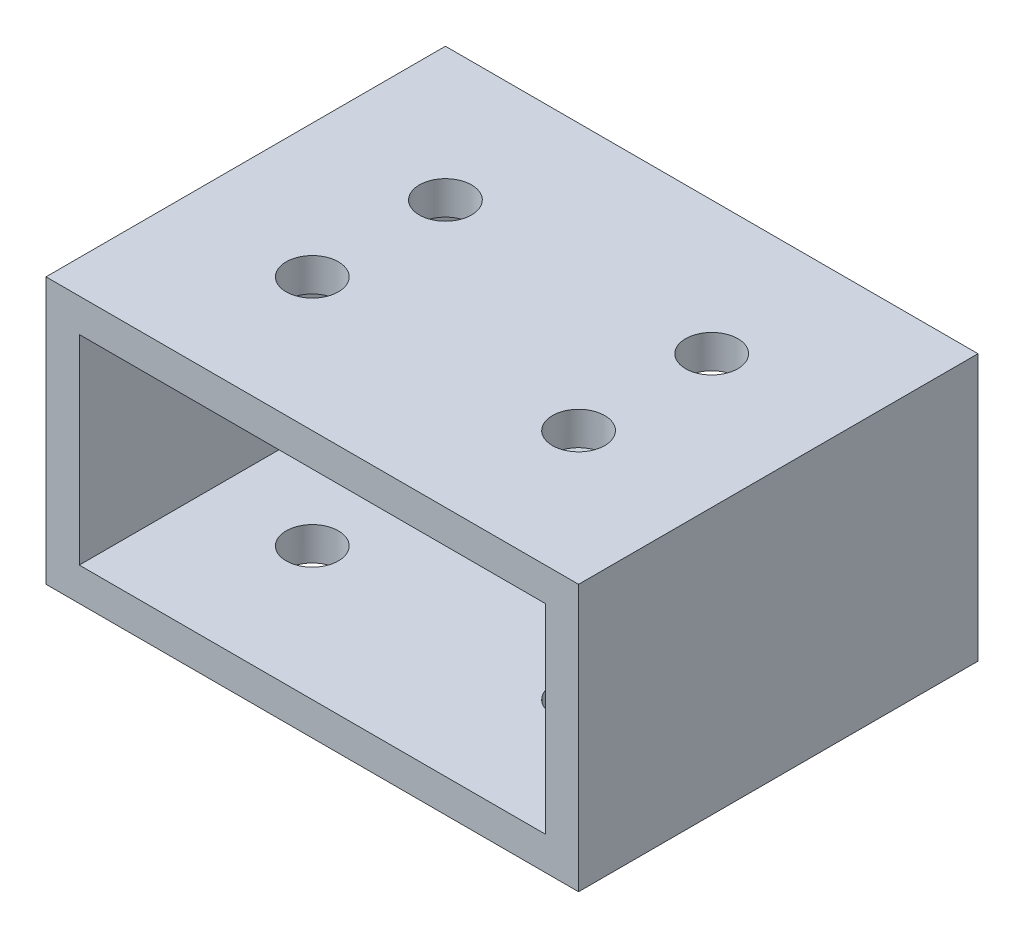
ISO-10303-21;
HEADER;
FILE_DESCRIPTION(('STEP AP214'),'2;1');
FILE_NAME('part.step','',(''),(''),'','','');
FILE_SCHEMA(('AUTOMOTIVE_DESIGN { 1 0 10303 214 1 1 1 1 }'));
ENDSEC;
DATA;
#1=APPLICATION_CONTEXT('core data for automotive mechanical design processes');
#2=APPLICATION_PROTOCOL_DEFINITION('international standard','automotive_design',2000,#1);
#3=PRODUCT_CONTEXT('',#1,'mechanical');
#4=PRODUCT('Part','Part','',(#3));
#5=PRODUCT_RELATED_PRODUCT_CATEGORY('part','',(#4));
#6=PRODUCT_DEFINITION_FORMATION('','',#4);
#7=PRODUCT_DEFINITION_CONTEXT('part definition',#1,'design');
#8=PRODUCT_DEFINITION('design','',#6,#7);
#9=PRODUCT_DEFINITION_SHAPE('','',#8);
#10=(LENGTH_UNIT() NAMED_UNIT(*) SI_UNIT(.MILLI.,.METRE.));
#11=(NAMED_UNIT(*) PLANE_ANGLE_UNIT() SI_UNIT($,.RADIAN.));
#12=(NAMED_UNIT(*) SI_UNIT($,.STERADIAN.) SOLID_ANGLE_UNIT());
#13=UNCERTAINTY_MEASURE_WITH_UNIT(LENGTH_MEASURE(1.E-05),#10,'distance_accuracy_value','');
#14=(GEOMETRIC_REPRESENTATION_CONTEXT(3) GLOBAL_UNCERTAINTY_ASSIGNED_CONTEXT((#13)) GLOBAL_UNIT_ASSIGNED_CONTEXT((#10,
#11,#12)) REPRESENTATION_CONTEXT('',''));
#15=CARTESIAN_POINT('',(0.,0.,0.));
#16=DIRECTION('',(0.,0.,1.));
#17=DIRECTION('',(1.,0.,0.));
#18=AXIS2_PLACEMENT_3D('',#15,#16,#17);
#19=CARTESIAN_POINT('',(0.,0.,19.05));
#20=DIRECTION('',(0.,0.,1.));
#21=DIRECTION('',(1.,0.,0.));
#22=AXIS2_PLACEMENT_3D('',#19,#20,#21);
#23=PLANE('',#22);
#24=DIRECTION('',(0.,-1.,0.));
#25=VECTOR('',#24,1.);
#26=CARTESIAN_POINT('',(0.,0.,19.05));
#27=LINE('',#26,#25);
#28=CARTESIAN_POINT('',(0.,25.4,19.05));
#29=VERTEX_POINT('',#28);
#30=CARTESIAN_POINT('',(0.,0.,19.05));
#31=VERTEX_POINT('',#30);
#32=EDGE_CURVE('E181',#29,#31,#27,.T.);
#33=ORIENTED_EDGE('',*,*,#32,.T.);
#34=DIRECTION('',(1.,0.,0.));
#35=VECTOR('',#34,1.);
#36=CARTESIAN_POINT('',(0.,0.,19.05));
#37=LINE('',#36,#35);
#38=CARTESIAN_POINT('',(50.8,0.,19.05));
#39=VERTEX_POINT('',#38);
#40=EDGE_CURVE('E185',#31,#39,#37,.T.);
#41=ORIENTED_EDGE('',*,*,#40,.T.);
#42=DIRECTION('',(0.,1.,0.));
#43=VECTOR('',#42,1.);
#44=CARTESIAN_POINT('',(50.8,0.,19.05));
#45=LINE('',#44,#43);
#46=CARTESIAN_POINT('',(50.8,25.4,19.05));
#47=VERTEX_POINT('',#46);
#48=EDGE_CURVE('E189',#39,#47,#45,.T.);
#49=ORIENTED_EDGE('',*,*,#48,.T.);
#50=DIRECTION('',(-1.,0.,0.));
#51=VECTOR('',#50,1.);
#52=CARTESIAN_POINT('',(0.,25.4,19.05));
#53=LINE('',#52,#51);
#54=EDGE_CURVE('E192',#47,#29,#53,.T.);
#55=ORIENTED_EDGE('',*,*,#54,.T.);
#56=EDGE_LOOP('',(#33,#41,#49,#55));
#57=FACE_BOUND('',#56,.T.);
#58=DIRECTION('',(1.,0.,0.));
#59=VECTOR('',#58,1.);
#60=CARTESIAN_POINT('',(0.,3.175,19.05));
#61=LINE('',#60,#59);
#62=CARTESIAN_POINT('',(3.175,3.175,19.05));
#63=VERTEX_POINT('',#62);
#64=CARTESIAN_POINT('',(47.625,3.175,19.05));
#65=VERTEX_POINT('',#64);
#66=EDGE_CURVE('E140',#63,#65,#61,.T.);
#67=ORIENTED_EDGE('',*,*,#66,.F.);
#68=DIRECTION('',(0.,-1.,0.));
#69=VECTOR('',#68,1.);
#70=CARTESIAN_POINT('',(3.175,0.,19.05));
#71=LINE('',#70,#69);
#72=CARTESIAN_POINT('',(3.175,22.225,19.05));
#73=VERTEX_POINT('',#72);
#74=EDGE_CURVE('E131',#73,#63,#71,.T.);
#75=ORIENTED_EDGE('',*,*,#74,.F.);
#76=DIRECTION('',(-1.,0.,0.));
#77=VECTOR('',#76,1.);
#78=CARTESIAN_POINT('',(0.,22.225,19.05));
#79=LINE('',#78,#77);
#80=CARTESIAN_POINT('',(47.625,22.225,19.05));
#81=VERTEX_POINT('',#80);
#82=EDGE_CURVE('E157',#81,#73,#79,.T.);
#83=ORIENTED_EDGE('',*,*,#82,.F.);
#84=DIRECTION('',(0.,1.,0.));
#85=VECTOR('',#84,1.);
#86=CARTESIAN_POINT('',(47.625,0.,19.05));
#87=LINE('',#86,#85);
#88=EDGE_CURVE('E153',#65,#81,#87,.T.);
#89=ORIENTED_EDGE('',*,*,#88,.F.);
#90=EDGE_LOOP('',(#67,#75,#83,#89));
#91=FACE_BOUND('',#90,.T.);
#92=ADVANCED_FACE('F63',(#57,#91),#23,.T.);
#93=CARTESIAN_POINT('',(0.,0.,-19.05));
#94=DIRECTION('',(0.,0.,1.));
#95=DIRECTION('',(1.,0.,0.));
#96=AXIS2_PLACEMENT_3D('',#93,#94,#95);
#97=PLANE('',#96);
#98=DIRECTION('',(0.,-1.,0.));
#99=VECTOR('',#98,1.);
#100=CARTESIAN_POINT('',(0.,0.,-19.05));
#101=LINE('',#100,#99);
#102=CARTESIAN_POINT('',(0.,25.4,-19.05));
#103=VERTEX_POINT('',#102);
#104=CARTESIAN_POINT('',(0.,0.,-19.05));
#105=VERTEX_POINT('',#104);
#106=EDGE_CURVE('E149',#103,#105,#101,.T.);
#107=ORIENTED_EDGE('',*,*,#106,.F.);
#108=DIRECTION('',(-1.,0.,0.));
#109=VECTOR('',#108,1.);
#110=CARTESIAN_POINT('',(0.,25.4,-19.05));
#111=LINE('',#110,#109);
#112=CARTESIAN_POINT('',(50.8,25.4,-19.05));
#113=VERTEX_POINT('',#112);
#114=EDGE_CURVE('E186',#113,#103,#111,.T.);
#115=ORIENTED_EDGE('',*,*,#114,.F.);
#116=DIRECTION('',(0.,1.,0.));
#117=VECTOR('',#116,1.);
#118=CARTESIAN_POINT('',(50.8,0.,-19.05));
#119=LINE('',#118,#117);
#120=CARTESIAN_POINT('',(50.8,0.,-19.05));
#121=VERTEX_POINT('',#120);
#122=EDGE_CURVE('E202',#121,#113,#119,.T.);
#123=ORIENTED_EDGE('',*,*,#122,.F.);
#124=DIRECTION('',(1.,0.,0.));
#125=VECTOR('',#124,1.);
#126=CARTESIAN_POINT('',(0.,0.,-19.05));
#127=LINE('',#126,#125);
#128=EDGE_CURVE('E199',#105,#121,#127,.T.);
#129=ORIENTED_EDGE('',*,*,#128,.F.);
#130=EDGE_LOOP('',(#107,#115,#123,#129));
#131=FACE_BOUND('',#130,.T.);
#132=DIRECTION('',(0.,-1.,0.));
#133=VECTOR('',#132,1.);
#134=CARTESIAN_POINT('',(3.175,0.,-19.05));
#135=LINE('',#134,#133);
#136=CARTESIAN_POINT('',(3.175,22.225,-19.05));
#137=VERTEX_POINT('',#136);
#138=CARTESIAN_POINT('',(3.175,3.175,-19.05));
#139=VERTEX_POINT('',#138);
#140=EDGE_CURVE('E89',#137,#139,#135,.T.);
#141=ORIENTED_EDGE('',*,*,#140,.T.);
#142=DIRECTION('',(1.,0.,0.));
#143=VECTOR('',#142,1.);
#144=CARTESIAN_POINT('',(0.,3.175,-19.05));
#145=LINE('',#144,#143);
#146=CARTESIAN_POINT('',(47.625,3.175,-19.05));
#147=VERTEX_POINT('',#146);
#148=EDGE_CURVE('E147',#139,#147,#145,.T.);
#149=ORIENTED_EDGE('',*,*,#148,.T.);
#150=DIRECTION('',(0.,1.,0.));
#151=VECTOR('',#150,1.);
#152=CARTESIAN_POINT('',(47.625,0.,-19.05));
#153=LINE('',#152,#151);
#154=CARTESIAN_POINT('',(47.625,22.225,-19.05));
#155=VERTEX_POINT('',#154);
#156=EDGE_CURVE('E168',#147,#155,#153,.T.);
#157=ORIENTED_EDGE('',*,*,#156,.T.);
#158=DIRECTION('',(-1.,0.,0.));
#159=VECTOR('',#158,1.);
#160=CARTESIAN_POINT('',(0.,22.225,-19.05));
#161=LINE('',#160,#159);
#162=EDGE_CURVE('E141',#155,#137,#161,.T.);
#163=ORIENTED_EDGE('',*,*,#162,.T.);
#164=EDGE_LOOP('',(#141,#149,#157,#163));
#165=FACE_BOUND('',#164,.T.);
#166=ADVANCED_FACE('F266',(#131,#165),#97,.F.);
#167=CARTESIAN_POINT('',(0.,0.,19.05));
#168=DIRECTION('',(1.,0.,0.));
#169=DIRECTION('',(0.,0.,-1.));
#170=AXIS2_PLACEMENT_3D('',#167,#168,#169);
#171=PLANE('',#170);
#172=ORIENTED_EDGE('',*,*,#106,.T.);
#173=DIRECTION('',(0.,0.,-1.));
#174=VECTOR('',#173,1.);
#175=CARTESIAN_POINT('',(0.,0.,19.05));
#176=LINE('',#175,#174);
#177=EDGE_CURVE('E12',#31,#105,#176,.T.);
#178=ORIENTED_EDGE('',*,*,#177,.F.);
#179=ORIENTED_EDGE('',*,*,#32,.F.);
#180=DIRECTION('',(0.,0.,-1.));
#181=VECTOR('',#180,1.);
#182=CARTESIAN_POINT('',(0.,25.4,19.05));
#183=LINE('',#182,#181);
#184=EDGE_CURVE('E195',#29,#103,#183,.T.);
#185=ORIENTED_EDGE('',*,*,#184,.T.);
#186=EDGE_LOOP('',(#172,#178,#179,#185));
#187=FACE_BOUND('',#186,.T.);
#188=ADVANCED_FACE('F65',(#187),#171,.F.);
#189=CARTESIAN_POINT('',(0.,0.,19.05));
#190=DIRECTION('',(0.,1.,0.));
#191=DIRECTION('',(0.,0.,1.));
#192=AXIS2_PLACEMENT_3D('',#189,#190,#191);
#193=PLANE('',#192);
#194=CARTESIAN_POINT('',(12.7,0.,-6.35000000000001));
#195=DIRECTION('',(0.,1.,0.));
#196=DIRECTION('',(0.,0.,-1.));
#197=AXIS2_PLACEMENT_3D('',#194,#195,#196);
#198=CIRCLE('',#197,2.4892);
#199=CARTESIAN_POINT('',(12.7,0.,-8.83920000000001));
#200=VERTEX_POINT('',#199);
#201=EDGE_CURVE('E302',#200,#200,#198,.T.);
#202=ORIENTED_EDGE('',*,*,#201,.T.);
#203=EDGE_LOOP('',(#202));
#204=FACE_BOUND('',#203,.T.);
#205=CARTESIAN_POINT('',(12.7,0.,6.34999999999998));
#206=DIRECTION('',(0.,1.,0.));
#207=DIRECTION('',(0.,0.,-1.));
#208=AXIS2_PLACEMENT_3D('',#205,#206,#207);
#209=CIRCLE('',#208,2.4892);
#210=CARTESIAN_POINT('',(12.7,0.,3.86079999999999));
#211=VERTEX_POINT('',#210);
#212=EDGE_CURVE('E306',#211,#211,#209,.T.);
#213=ORIENTED_EDGE('',*,*,#212,.T.);
#214=EDGE_LOOP('',(#213));
#215=FACE_BOUND('',#214,.T.);
#216=CARTESIAN_POINT('',(38.1,0.,6.34999999999999));
#217=DIRECTION('',(0.,1.,0.));
#218=DIRECTION('',(0.,0.,1.));
#219=AXIS2_PLACEMENT_3D('',#216,#217,#218);
#220=CIRCLE('',#219,2.4892);
#221=CARTESIAN_POINT('',(38.1,0.,8.83919999999999));
#222=VERTEX_POINT('',#221);
#223=EDGE_CURVE('E310',#222,#222,#220,.T.);
#224=ORIENTED_EDGE('',*,*,#223,.T.);
#225=EDGE_LOOP('',(#224));
#226=FACE_BOUND('',#225,.T.);
#227=CARTESIAN_POINT('',(38.1,0.,-6.35000000000001));
#228=DIRECTION('',(0.,1.,0.));
#229=DIRECTION('',(0.,0.,1.));
#230=AXIS2_PLACEMENT_3D('',#227,#228,#229);
#231=CIRCLE('',#230,2.4892);
#232=CARTESIAN_POINT('',(38.1,0.,-3.86080000000001));
#233=VERTEX_POINT('',#232);
#234=EDGE_CURVE('E222',#233,#233,#231,.T.);
#235=ORIENTED_EDGE('',*,*,#234,.T.);
#236=EDGE_LOOP('',(#235));
#237=FACE_BOUND('',#236,.T.);
#238=ORIENTED_EDGE('',*,*,#128,.T.);
#239=DIRECTION('',(0.,0.,-1.));
#240=VECTOR('',#239,1.);
#241=CARTESIAN_POINT('',(50.8,0.,19.05));
#242=LINE('',#241,#240);
#243=EDGE_CURVE('E73',#39,#121,#242,.T.);
#244=ORIENTED_EDGE('',*,*,#243,.F.);
#245=ORIENTED_EDGE('',*,*,#40,.F.);
#246=ORIENTED_EDGE('',*,*,#177,.T.);
#247=EDGE_LOOP('',(#238,#244,#245,#246));
#248=FACE_BOUND('',#247,.T.);
#249=ADVANCED_FACE('F291',(#204,#215,#226,#237,#248),#193,.F.);
#250=CARTESIAN_POINT('',(50.8,0.,19.05));
#251=DIRECTION('',(-1.,0.,0.));
#252=DIRECTION('',(0.,0.,1.));
#253=AXIS2_PLACEMENT_3D('',#250,#251,#252);
#254=PLANE('',#253);
#255=ORIENTED_EDGE('',*,*,#122,.T.);
#256=DIRECTION('',(0.,0.,-1.));
#257=VECTOR('',#256,1.);
#258=CARTESIAN_POINT('',(50.8,25.4,19.05));
#259=LINE('',#258,#257);
#260=EDGE_CURVE('E210',#47,#113,#259,.T.);
#261=ORIENTED_EDGE('',*,*,#260,.F.);
#262=ORIENTED_EDGE('',*,*,#48,.F.);
#263=ORIENTED_EDGE('',*,*,#243,.T.);
#264=EDGE_LOOP('',(#255,#261,#262,#263));
#265=FACE_BOUND('',#264,.T.);
#266=ADVANCED_FACE('F288',(#265),#254,.F.);
#267=CARTESIAN_POINT('',(0.,25.4,19.05));
#268=DIRECTION('',(0.,-1.,0.));
#269=DIRECTION('',(0.,0.,-1.));
#270=AXIS2_PLACEMENT_3D('',#267,#268,#269);
#271=PLANE('',#270);
#272=CARTESIAN_POINT('',(12.7,25.4,-6.35000000000001));
#273=DIRECTION('',(0.,1.,0.));
#274=DIRECTION('',(0.,0.,-1.));
#275=AXIS2_PLACEMENT_3D('',#272,#273,#274);
#276=CIRCLE('',#275,2.4892);
#277=CARTESIAN_POINT('',(12.7,25.4,-8.83920000000001));
#278=VERTEX_POINT('',#277);
#279=EDGE_CURVE('E332',#278,#278,#276,.T.);
#280=ORIENTED_EDGE('',*,*,#279,.F.);
#281=EDGE_LOOP('',(#280));
#282=FACE_BOUND('',#281,.T.);
#283=CARTESIAN_POINT('',(12.7,25.4,6.34999999999998));
#284=DIRECTION('',(0.,1.,0.));
#285=DIRECTION('',(0.,0.,-1.));
#286=AXIS2_PLACEMENT_3D('',#283,#284,#285);
#287=CIRCLE('',#286,2.4892);
#288=CARTESIAN_POINT('',(12.7,25.4,3.86079999999999));
#289=VERTEX_POINT('',#288);
#290=EDGE_CURVE('E338',#289,#289,#287,.T.);
#291=ORIENTED_EDGE('',*,*,#290,.F.);
#292=EDGE_LOOP('',(#291));
#293=FACE_BOUND('',#292,.T.);
#294=CARTESIAN_POINT('',(38.1,25.4,6.34999999999999));
#295=DIRECTION('',(0.,1.,0.));
#296=DIRECTION('',(0.,0.,1.));
#297=AXIS2_PLACEMENT_3D('',#294,#295,#296);
#298=CIRCLE('',#297,2.4892);
#299=CARTESIAN_POINT('',(38.1,25.4,8.83919999999999));
#300=VERTEX_POINT('',#299);
#301=EDGE_CURVE('E344',#300,#300,#298,.T.);
#302=ORIENTED_EDGE('',*,*,#301,.F.);
#303=EDGE_LOOP('',(#302));
#304=FACE_BOUND('',#303,.T.);
#305=CARTESIAN_POINT('',(38.1,25.4,-6.35000000000001));
#306=DIRECTION('',(0.,1.,0.));
#307=DIRECTION('',(0.,0.,1.));
#308=AXIS2_PLACEMENT_3D('',#305,#306,#307);
#309=CIRCLE('',#308,2.4892);
#310=CARTESIAN_POINT('',(38.1,25.4,-3.86080000000001));
#311=VERTEX_POINT('',#310);
#312=EDGE_CURVE('E327',#311,#311,#309,.T.);
#313=ORIENTED_EDGE('',*,*,#312,.F.);
#314=EDGE_LOOP('',(#313));
#315=FACE_BOUND('',#314,.T.);
#316=ORIENTED_EDGE('',*,*,#114,.T.);
#317=ORIENTED_EDGE('',*,*,#184,.F.);
#318=ORIENTED_EDGE('',*,*,#54,.F.);
#319=ORIENTED_EDGE('',*,*,#260,.T.);
#320=EDGE_LOOP('',(#316,#317,#318,#319));
#321=FACE_BOUND('',#320,.T.);
#322=ADVANCED_FACE('F285',(#282,#293,#304,#315,#321),#271,.F.);
#323=CARTESIAN_POINT('',(3.175,0.,19.05));
#324=DIRECTION('',(1.,0.,0.));
#325=DIRECTION('',(0.,0.,-1.));
#326=AXIS2_PLACEMENT_3D('',#323,#324,#325);
#327=PLANE('',#326);
#328=ORIENTED_EDGE('',*,*,#140,.F.);
#329=DIRECTION('',(0.,0.,-1.));
#330=VECTOR('',#329,1.);
#331=CARTESIAN_POINT('',(3.175,22.225,19.05));
#332=LINE('',#331,#330);
#333=EDGE_CURVE('E135',#73,#137,#332,.T.);
#334=ORIENTED_EDGE('',*,*,#333,.F.);
#335=ORIENTED_EDGE('',*,*,#74,.T.);
#336=DIRECTION('',(0.,0.,-1.));
#337=VECTOR('',#336,1.);
#338=CARTESIAN_POINT('',(3.175,3.175,19.05));
#339=LINE('',#338,#337);
#340=EDGE_CURVE('E134',#63,#139,#339,.T.);
#341=ORIENTED_EDGE('',*,*,#340,.T.);
#342=EDGE_LOOP('',(#328,#334,#335,#341));
#343=FACE_BOUND('',#342,.T.);
#344=ADVANCED_FACE('F133',(#343),#327,.T.);
#345=CARTESIAN_POINT('',(0.,3.175,19.05));
#346=DIRECTION('',(0.,1.,0.));
#347=DIRECTION('',(0.,0.,1.));
#348=AXIS2_PLACEMENT_3D('',#345,#346,#347);
#349=PLANE('',#348);
#350=CARTESIAN_POINT('',(12.7,3.175,-6.35000000000001));
#351=DIRECTION('',(0.,1.,0.));
#352=DIRECTION('',(0.,0.,1.));
#353=AXIS2_PLACEMENT_3D('',#350,#351,#352);
#354=CIRCLE('',#353,2.4892);
#355=CARTESIAN_POINT('',(12.7,3.175,-3.86080000000001));
#356=VERTEX_POINT('',#355);
#357=EDGE_CURVE('E165',#356,#356,#354,.T.);
#358=ORIENTED_EDGE('',*,*,#357,.F.);
#359=EDGE_LOOP('',(#358));
#360=FACE_BOUND('',#359,.T.);
#361=CARTESIAN_POINT('',(12.7,3.175,6.34999999999998));
#362=DIRECTION('',(0.,1.,0.));
#363=DIRECTION('',(0.,0.,1.));
#364=AXIS2_PLACEMENT_3D('',#361,#362,#363);
#365=CIRCLE('',#364,2.4892);
#366=CARTESIAN_POINT('',(12.7,3.175,8.83919999999998));
#367=VERTEX_POINT('',#366);
#368=EDGE_CURVE('E230',#367,#367,#365,.T.);
#369=ORIENTED_EDGE('',*,*,#368,.F.);
#370=EDGE_LOOP('',(#369));
#371=FACE_BOUND('',#370,.T.);
#372=CARTESIAN_POINT('',(38.1,3.175,6.34999999999999));
#373=DIRECTION('',(0.,1.,0.));
#374=DIRECTION('',(0.,0.,1.));
#375=AXIS2_PLACEMENT_3D('',#372,#373,#374);
#376=CIRCLE('',#375,2.4892);
#377=CARTESIAN_POINT('',(38.1,3.175,8.83919999999999));
#378=VERTEX_POINT('',#377);
#379=EDGE_CURVE('E226',#378,#378,#376,.T.);
#380=ORIENTED_EDGE('',*,*,#379,.F.);
#381=EDGE_LOOP('',(#380));
#382=FACE_BOUND('',#381,.T.);
#383=CARTESIAN_POINT('',(38.1,3.175,-6.35000000000001));
#384=DIRECTION('',(0.,1.,0.));
#385=DIRECTION('',(0.,0.,1.));
#386=AXIS2_PLACEMENT_3D('',#383,#384,#385);
#387=CIRCLE('',#386,2.4892);
#388=CARTESIAN_POINT('',(38.1,3.175,-3.86080000000001));
#389=VERTEX_POINT('',#388);
#390=EDGE_CURVE('E221',#389,#389,#387,.T.);
#391=ORIENTED_EDGE('',*,*,#390,.F.);
#392=EDGE_LOOP('',(#391));
#393=FACE_BOUND('',#392,.T.);
#394=ORIENTED_EDGE('',*,*,#148,.F.);
#395=ORIENTED_EDGE('',*,*,#340,.F.);
#396=ORIENTED_EDGE('',*,*,#66,.T.);
#397=DIRECTION('',(0.,0.,-1.));
#398=VECTOR('',#397,1.);
#399=CARTESIAN_POINT('',(47.625,3.175,19.05));
#400=LINE('',#399,#398);
#401=EDGE_CURVE('E150',#65,#147,#400,.T.);
#402=ORIENTED_EDGE('',*,*,#401,.T.);
#403=EDGE_LOOP('',(#394,#395,#396,#402));
#404=FACE_BOUND('',#403,.T.);
#405=ADVANCED_FACE('F144',(#360,#371,#382,#393,#404),#349,.T.);
#406=CARTESIAN_POINT('',(47.625,0.,19.05));
#407=DIRECTION('',(-1.,0.,0.));
#408=DIRECTION('',(0.,0.,1.));
#409=AXIS2_PLACEMENT_3D('',#406,#407,#408);
#410=PLANE('',#409);
#411=ORIENTED_EDGE('',*,*,#156,.F.);
#412=ORIENTED_EDGE('',*,*,#401,.F.);
#413=ORIENTED_EDGE('',*,*,#88,.T.);
#414=DIRECTION('',(0.,0.,-1.));
#415=VECTOR('',#414,1.);
#416=CARTESIAN_POINT('',(47.625,22.225,19.05));
#417=LINE('',#416,#415);
#418=EDGE_CURVE('E81',#81,#155,#417,.T.);
#419=ORIENTED_EDGE('',*,*,#418,.T.);
#420=EDGE_LOOP('',(#411,#412,#413,#419));
#421=FACE_BOUND('',#420,.T.);
#422=ADVANCED_FACE('F258',(#421),#410,.T.);
#423=CARTESIAN_POINT('',(0.,22.225,19.05));
#424=DIRECTION('',(0.,-1.,0.));
#425=DIRECTION('',(0.,0.,-1.));
#426=AXIS2_PLACEMENT_3D('',#423,#424,#425);
#427=PLANE('',#426);
#428=CARTESIAN_POINT('',(12.7,22.225,-6.35000000000001));
#429=DIRECTION('',(0.,-1.,0.));
#430=DIRECTION('',(0.,0.,-1.));
#431=AXIS2_PLACEMENT_3D('',#428,#429,#430);
#432=CIRCLE('',#431,2.4892);
#433=CARTESIAN_POINT('',(12.7,22.225,-8.83920000000001));
#434=VERTEX_POINT('',#433);
#435=EDGE_CURVE('E67',#434,#434,#432,.T.);
#436=ORIENTED_EDGE('',*,*,#435,.F.);
#437=EDGE_LOOP('',(#436));
#438=FACE_BOUND('',#437,.T.);
#439=CARTESIAN_POINT('',(12.7,22.225,6.34999999999998));
#440=DIRECTION('',(0.,-1.,0.));
#441=DIRECTION('',(0.,0.,-1.));
#442=AXIS2_PLACEMENT_3D('',#439,#440,#441);
#443=CIRCLE('',#442,2.4892);
#444=CARTESIAN_POINT('',(12.7,22.225,3.86079999999999));
#445=VERTEX_POINT('',#444);
#446=EDGE_CURVE('E227',#445,#445,#443,.T.);
#447=ORIENTED_EDGE('',*,*,#446,.F.);
#448=EDGE_LOOP('',(#447));
#449=FACE_BOUND('',#448,.T.);
#450=CARTESIAN_POINT('',(38.1,22.225,6.34999999999999));
#451=DIRECTION('',(0.,-1.,0.));
#452=DIRECTION('',(0.,0.,-1.));
#453=AXIS2_PLACEMENT_3D('',#450,#451,#452);
#454=CIRCLE('',#453,2.4892);
#455=CARTESIAN_POINT('',(38.1,22.225,3.86079999999999));
#456=VERTEX_POINT('',#455);
#457=EDGE_CURVE('E223',#456,#456,#454,.T.);
#458=ORIENTED_EDGE('',*,*,#457,.F.);
#459=EDGE_LOOP('',(#458));
#460=FACE_BOUND('',#459,.T.);
#461=CARTESIAN_POINT('',(38.1,22.225,-6.35000000000001));
#462=DIRECTION('',(0.,-1.,0.));
#463=DIRECTION('',(0.,0.,-1.));
#464=AXIS2_PLACEMENT_3D('',#461,#462,#463);
#465=CIRCLE('',#464,2.4892);
#466=CARTESIAN_POINT('',(38.1,22.225,-8.83920000000001));
#467=VERTEX_POINT('',#466);
#468=EDGE_CURVE('E217',#467,#467,#465,.T.);
#469=ORIENTED_EDGE('',*,*,#468,.F.);
#470=EDGE_LOOP('',(#469));
#471=FACE_BOUND('',#470,.T.);
#472=ORIENTED_EDGE('',*,*,#162,.F.);
#473=ORIENTED_EDGE('',*,*,#418,.F.);
#474=ORIENTED_EDGE('',*,*,#82,.T.);
#475=ORIENTED_EDGE('',*,*,#333,.T.);
#476=EDGE_LOOP('',(#472,#473,#474,#475));
#477=FACE_BOUND('',#476,.T.);
#478=ADVANCED_FACE('F254',(#438,#449,#460,#471,#477),#427,.T.);
#479=CARTESIAN_POINT('',(38.1,0.,-6.35000000000001));
#480=DIRECTION('',(0.,1.,0.));
#481=DIRECTION('',(0.,0.,1.));
#482=AXIS2_PLACEMENT_3D('',#479,#480,#481);
#483=CYLINDRICAL_SURFACE('',#482,2.4892);
#484=ORIENTED_EDGE('',*,*,#468,.T.);
#485=EDGE_LOOP('',(#484));
#486=FACE_BOUND('',#485,.T.);
#487=ORIENTED_EDGE('',*,*,#312,.T.);
#488=EDGE_LOOP('',(#487));
#489=FACE_BOUND('',#488,.T.);
#490=ADVANCED_FACE('F257',(#486,#489),#483,.F.);
#491=CARTESIAN_POINT('',(38.1,0.,6.34999999999999));
#492=DIRECTION('',(0.,1.,0.));
#493=DIRECTION('',(0.,0.,1.));
#494=AXIS2_PLACEMENT_3D('',#491,#492,#493);
#495=CYLINDRICAL_SURFACE('',#494,2.4892);
#496=ORIENTED_EDGE('',*,*,#457,.T.);
#497=EDGE_LOOP('',(#496));
#498=FACE_BOUND('',#497,.T.);
#499=ORIENTED_EDGE('',*,*,#301,.T.);
#500=EDGE_LOOP('',(#499));
#501=FACE_BOUND('',#500,.T.);
#502=ADVANCED_FACE('F351',(#498,#501),#495,.F.);
#503=CARTESIAN_POINT('',(12.7,0.,6.34999999999998));
#504=DIRECTION('',(0.,1.,0.));
#505=DIRECTION('',(0.,0.,1.));
#506=AXIS2_PLACEMENT_3D('',#503,#504,#505);
#507=CYLINDRICAL_SURFACE('',#506,2.4892);
#508=ORIENTED_EDGE('',*,*,#446,.T.);
#509=EDGE_LOOP('',(#508));
#510=FACE_BOUND('',#509,.T.);
#511=ORIENTED_EDGE('',*,*,#290,.T.);
#512=EDGE_LOOP('',(#511));
#513=FACE_BOUND('',#512,.T.);
#514=ADVANCED_FACE('F363',(#510,#513),#507,.F.);
#515=CARTESIAN_POINT('',(12.7,0.,-6.35000000000001));
#516=DIRECTION('',(0.,1.,0.));
#517=DIRECTION('',(0.,0.,1.));
#518=AXIS2_PLACEMENT_3D('',#515,#516,#517);
#519=CYLINDRICAL_SURFACE('',#518,2.4892);
#520=ORIENTED_EDGE('',*,*,#435,.T.);
#521=EDGE_LOOP('',(#520));
#522=FACE_BOUND('',#521,.T.);
#523=ORIENTED_EDGE('',*,*,#279,.T.);
#524=EDGE_LOOP('',(#523));
#525=FACE_BOUND('',#524,.T.);
#526=ADVANCED_FACE('F251',(#522,#525),#519,.F.);
#527=ORIENTED_EDGE('',*,*,#390,.T.);
#528=EDGE_LOOP('',(#527));
#529=FACE_BOUND('',#528,.T.);
#530=ORIENTED_EDGE('',*,*,#234,.F.);
#531=EDGE_LOOP('',(#530));
#532=FACE_BOUND('',#531,.T.);
#533=ADVANCED_FACE('F359',(#529,#532),#483,.F.);
#534=ORIENTED_EDGE('',*,*,#379,.T.);
#535=EDGE_LOOP('',(#534));
#536=FACE_BOUND('',#535,.T.);
#537=ORIENTED_EDGE('',*,*,#223,.F.);
#538=EDGE_LOOP('',(#537));
#539=FACE_BOUND('',#538,.T.);
#540=ADVANCED_FACE('F366',(#536,#539),#495,.F.);
#541=ORIENTED_EDGE('',*,*,#368,.T.);
#542=EDGE_LOOP('',(#541));
#543=FACE_BOUND('',#542,.T.);
#544=ORIENTED_EDGE('',*,*,#212,.F.);
#545=EDGE_LOOP('',(#544));
#546=FACE_BOUND('',#545,.T.);
#547=ADVANCED_FACE('F374',(#543,#546),#507,.F.);
#548=ORIENTED_EDGE('',*,*,#357,.T.);
#549=EDGE_LOOP('',(#548));
#550=FACE_BOUND('',#549,.T.);
#551=ORIENTED_EDGE('',*,*,#201,.F.);
#552=EDGE_LOOP('',(#551));
#553=FACE_BOUND('',#552,.T.);
#554=ADVANCED_FACE('F375',(#550,#553),#519,.F.);
#555=CLOSED_SHELL('',(#92,#166,#188,#249,#266,#322,#344,#405,#422,#478,#490,#502,#514,#526,#533,
#540,#547,#554));
#556=MANIFOLD_SOLID_BREP('B2',#555);
#557=ADVANCED_BREP_SHAPE_REPRESENTATION('',(#18,#556),#14);
#558=SHAPE_DEFINITION_REPRESENTATION(#9,#557);
ENDSEC;
END-ISO-10303-21;
